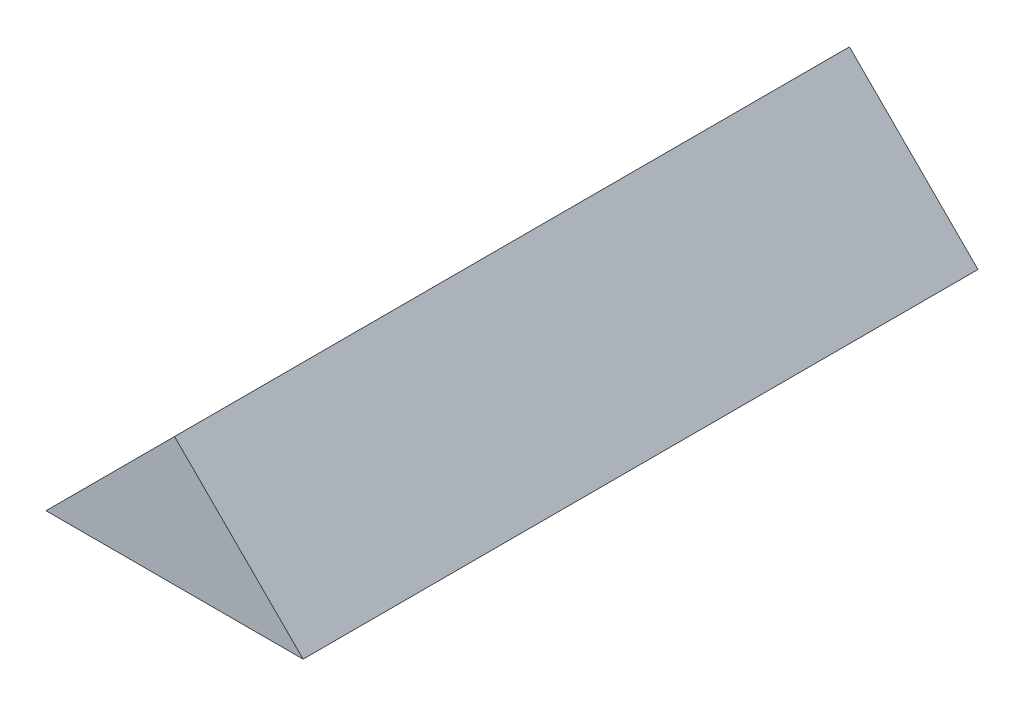
ISO-10303-21;
HEADER;
FILE_DESCRIPTION(('STEP AP214'),'2;1');
FILE_NAME('part.step','',(''),(''),'','','');
FILE_SCHEMA(('AUTOMOTIVE_DESIGN { 1 0 10303 214 1 1 1 1 }'));
ENDSEC;
DATA;
#1=APPLICATION_CONTEXT('core data for automotive mechanical design processes');
#2=APPLICATION_PROTOCOL_DEFINITION('international standard','automotive_design',2000,#1);
#3=PRODUCT_CONTEXT('',#1,'mechanical');
#4=PRODUCT('Part','Part','',(#3));
#5=PRODUCT_RELATED_PRODUCT_CATEGORY('part','',(#4));
#6=PRODUCT_DEFINITION_FORMATION('','',#4);
#7=PRODUCT_DEFINITION_CONTEXT('part definition',#1,'design');
#8=PRODUCT_DEFINITION('design','',#6,#7);
#9=PRODUCT_DEFINITION_SHAPE('','',#8);
#10=(LENGTH_UNIT() NAMED_UNIT(*) SI_UNIT(.MILLI.,.METRE.));
#11=(NAMED_UNIT(*) PLANE_ANGLE_UNIT() SI_UNIT($,.RADIAN.));
#12=(NAMED_UNIT(*) SI_UNIT($,.STERADIAN.) SOLID_ANGLE_UNIT());
#13=UNCERTAINTY_MEASURE_WITH_UNIT(LENGTH_MEASURE(1.E-05),#10,'distance_accuracy_value','');
#14=(GEOMETRIC_REPRESENTATION_CONTEXT(3) GLOBAL_UNCERTAINTY_ASSIGNED_CONTEXT((#13)) GLOBAL_UNIT_ASSIGNED_CONTEXT((#10,
#11,#12)) REPRESENTATION_CONTEXT('',''));
#15=CARTESIAN_POINT('',(0.,0.,0.));
#16=DIRECTION('',(0.,0.,1.));
#17=DIRECTION('',(1.,0.,0.));
#18=AXIS2_PLACEMENT_3D('',#15,#16,#17);
#19=CARTESIAN_POINT('',(0.,0.,-105.));
#20=DIRECTION('',(-0.707106781123095,0.70710678125,0.));
#21=DIRECTION('',(-0.70710678125,-0.707106781123095,0.));
#22=AXIS2_PLACEMENT_3D('',#19,#20,#21);
#23=PLANE('',#22);
#24=DIRECTION('',(-0.70710678125,-0.707106781123095,0.));
#25=VECTOR('',#24,1.);
#26=CARTESIAN_POINT('',(0.,0.,0.));
#27=LINE('',#26,#25);
#28=CARTESIAN_POINT('',(20.0000000035894,20.,0.));
#29=VERTEX_POINT('',#28);
#30=CARTESIAN_POINT('',(0.,0.,0.));
#31=VERTEX_POINT('',#30);
#32=EDGE_CURVE('E60',#29,#31,#27,.T.);
#33=ORIENTED_EDGE('',*,*,#32,.F.);
#34=DIRECTION('',(0.,0.,1.));
#35=VECTOR('',#34,1.);
#36=CARTESIAN_POINT('',(20.0000000035894,20.,-105.));
#37=LINE('',#36,#35);
#38=CARTESIAN_POINT('',(20.0000000035894,20.,-105.));
#39=VERTEX_POINT('',#38);
#40=EDGE_CURVE('E11',#39,#29,#37,.T.);
#41=ORIENTED_EDGE('',*,*,#40,.F.);
#42=DIRECTION('',(-0.70710678125,-0.707106781123095,0.));
#43=VECTOR('',#42,1.);
#44=CARTESIAN_POINT('',(0.,0.,-105.));
#45=LINE('',#44,#43);
#46=CARTESIAN_POINT('',(0.,0.,-105.));
#47=VERTEX_POINT('',#46);
#48=EDGE_CURVE('E62',#39,#47,#45,.T.);
#49=ORIENTED_EDGE('',*,*,#48,.T.);
#50=DIRECTION('',(0.,0.,1.));
#51=VECTOR('',#50,1.);
#52=CARTESIAN_POINT('',(0.,0.,-105.));
#53=LINE('',#52,#51);
#54=EDGE_CURVE('E29',#47,#31,#53,.T.);
#55=ORIENTED_EDGE('',*,*,#54,.T.);
#56=EDGE_LOOP('',(#33,#41,#49,#55));
#57=FACE_BOUND('',#56,.T.);
#58=ADVANCED_FACE('F26',(#57),#23,.T.);
#59=CARTESIAN_POINT('',(20.0000000035894,20.,-105.));
#60=DIRECTION('',(0.70710678125,0.707106781123095,0.));
#61=DIRECTION('',(-0.707106781123095,0.70710678125,0.));
#62=AXIS2_PLACEMENT_3D('',#59,#60,#61);
#63=PLANE('',#62);
#64=DIRECTION('',(-0.707106781123095,0.70710678125,0.));
#65=VECTOR('',#64,1.);
#66=CARTESIAN_POINT('',(20.0000000035894,20.,0.));
#67=LINE('',#66,#65);
#68=CARTESIAN_POINT('',(40.,0.,0.));
#69=VERTEX_POINT('',#68);
#70=EDGE_CURVE('E70',#69,#29,#67,.T.);
#71=ORIENTED_EDGE('',*,*,#70,.F.);
#72=DIRECTION('',(0.,0.,1.));
#73=VECTOR('',#72,1.);
#74=CARTESIAN_POINT('',(40.,0.,-105.));
#75=LINE('',#74,#73);
#76=CARTESIAN_POINT('',(40.,0.,-105.));
#77=VERTEX_POINT('',#76);
#78=EDGE_CURVE('E34',#77,#69,#75,.T.);
#79=ORIENTED_EDGE('',*,*,#78,.F.);
#80=DIRECTION('',(-0.707106781123095,0.70710678125,0.));
#81=VECTOR('',#80,1.);
#82=CARTESIAN_POINT('',(20.0000000035894,20.,-105.));
#83=LINE('',#82,#81);
#84=EDGE_CURVE('E65',#77,#39,#83,.T.);
#85=ORIENTED_EDGE('',*,*,#84,.T.);
#86=ORIENTED_EDGE('',*,*,#40,.T.);
#87=EDGE_LOOP('',(#71,#79,#85,#86));
#88=FACE_BOUND('',#87,.T.);
#89=ADVANCED_FACE('F80',(#88),#63,.T.);
#90=CARTESIAN_POINT('',(0.,0.,-105.));
#91=DIRECTION('',(0.,-1.,0.));
#92=DIRECTION('',(0.,0.,-1.));
#93=AXIS2_PLACEMENT_3D('',#90,#91,#92);
#94=PLANE('',#93);
#95=DIRECTION('',(1.,0.,0.));
#96=VECTOR('',#95,1.);
#97=CARTESIAN_POINT('',(0.,0.,0.));
#98=LINE('',#97,#96);
#99=EDGE_CURVE('E67',#31,#69,#98,.T.);
#100=ORIENTED_EDGE('',*,*,#99,.F.);
#101=ORIENTED_EDGE('',*,*,#54,.F.);
#102=DIRECTION('',(1.,0.,0.));
#103=VECTOR('',#102,1.);
#104=CARTESIAN_POINT('',(0.,0.,-105.));
#105=LINE('',#104,#103);
#106=EDGE_CURVE('E77',#47,#77,#105,.T.);
#107=ORIENTED_EDGE('',*,*,#106,.T.);
#108=ORIENTED_EDGE('',*,*,#78,.T.);
#109=EDGE_LOOP('',(#100,#101,#107,#108));
#110=FACE_BOUND('',#109,.T.);
#111=ADVANCED_FACE('F68',(#110),#94,.T.);
#112=CARTESIAN_POINT('',(20.0000000035894,20.,-105.));
#113=DIRECTION('',(0.,0.,-1.));
#114=DIRECTION('',(-1.,0.,0.));
#115=AXIS2_PLACEMENT_3D('',#112,#113,#114);
#116=PLANE('',#115);
#117=ORIENTED_EDGE('',*,*,#48,.F.);
#118=ORIENTED_EDGE('',*,*,#84,.F.);
#119=ORIENTED_EDGE('',*,*,#106,.F.);
#120=EDGE_LOOP('',(#117,#118,#119));
#121=FACE_BOUND('',#120,.T.);
#122=ADVANCED_FACE('F82',(#121),#116,.T.);
#123=CARTESIAN_POINT('',(20.0000000035894,20.,0.));
#124=DIRECTION('',(0.,0.,-1.));
#125=DIRECTION('',(-1.,0.,0.));
#126=AXIS2_PLACEMENT_3D('',#123,#124,#125);
#127=PLANE('',#126);
#128=ORIENTED_EDGE('',*,*,#32,.T.);
#129=ORIENTED_EDGE('',*,*,#99,.T.);
#130=ORIENTED_EDGE('',*,*,#70,.T.);
#131=EDGE_LOOP('',(#128,#129,#130));
#132=FACE_BOUND('',#131,.T.);
#133=ADVANCED_FACE('F72',(#132),#127,.F.);
#134=CLOSED_SHELL('',(#58,#89,#111,#122,#133));
#135=MANIFOLD_SOLID_BREP('B2',#134);
#136=ADVANCED_BREP_SHAPE_REPRESENTATION('',(#18,#135),#14);
#137=SHAPE_DEFINITION_REPRESENTATION(#9,#136);
ENDSEC;
END-ISO-10303-21;
